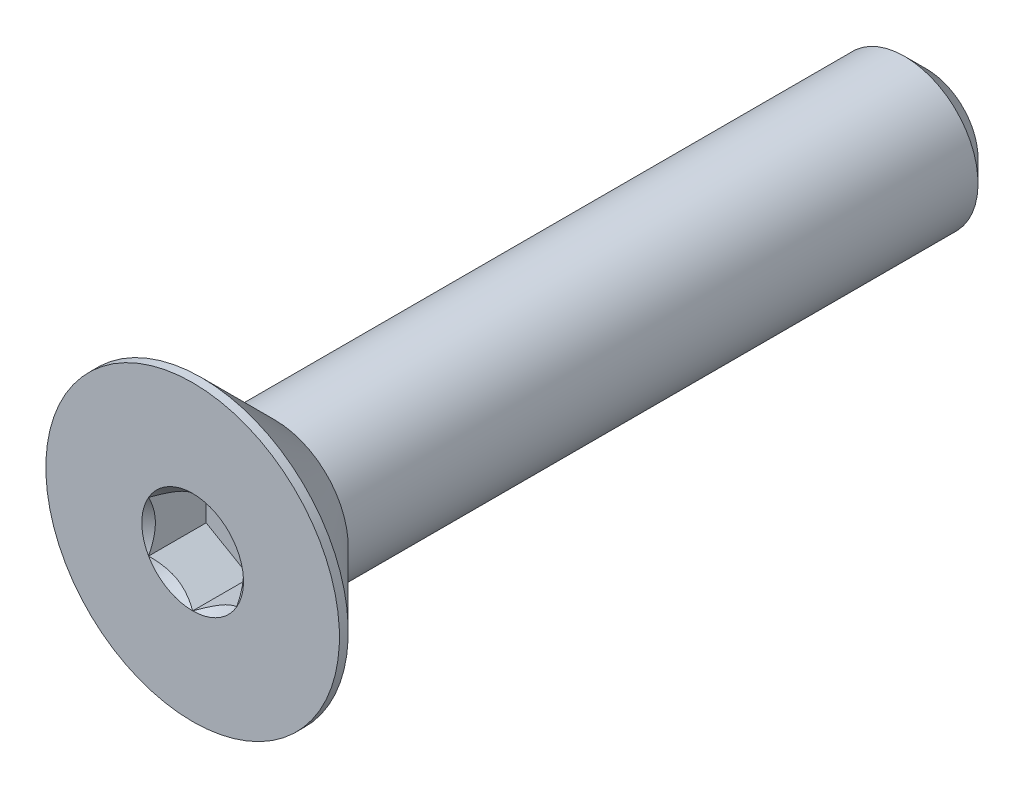
ISO-10303-21;
HEADER;
FILE_DESCRIPTION(('STEP AP214'),'2;1');
FILE_NAME('part.step','',(''),(''),'','','');
FILE_SCHEMA(('AUTOMOTIVE_DESIGN { 1 0 10303 214 1 1 1 1 }'));
ENDSEC;
DATA;
#1=APPLICATION_CONTEXT('core data for automotive mechanical design processes');
#2=APPLICATION_PROTOCOL_DEFINITION('international standard','automotive_design',2000,#1);
#3=PRODUCT_CONTEXT('',#1,'mechanical');
#4=PRODUCT('Part','Part','',(#3));
#5=PRODUCT_RELATED_PRODUCT_CATEGORY('part','',(#4));
#6=PRODUCT_DEFINITION_FORMATION('','',#4);
#7=PRODUCT_DEFINITION_CONTEXT('part definition',#1,'design');
#8=PRODUCT_DEFINITION('design','',#6,#7);
#9=PRODUCT_DEFINITION_SHAPE('','',#8);
#10=(LENGTH_UNIT() NAMED_UNIT(*) SI_UNIT(.MILLI.,.METRE.));
#11=(NAMED_UNIT(*) PLANE_ANGLE_UNIT() SI_UNIT($,.RADIAN.));
#12=(NAMED_UNIT(*) SI_UNIT($,.STERADIAN.) SOLID_ANGLE_UNIT());
#13=UNCERTAINTY_MEASURE_WITH_UNIT(LENGTH_MEASURE(1.E-05),#10,'distance_accuracy_value','');
#14=(GEOMETRIC_REPRESENTATION_CONTEXT(3) GLOBAL_UNCERTAINTY_ASSIGNED_CONTEXT((#13)) GLOBAL_UNIT_ASSIGNED_CONTEXT((#10,
#11,#12)) REPRESENTATION_CONTEXT('',''));
#15=CARTESIAN_POINT('',(0.,0.,0.));
#16=DIRECTION('',(0.,0.,1.));
#17=DIRECTION('',(1.,0.,0.));
#18=AXIS2_PLACEMENT_3D('',#15,#16,#17);
#19=CARTESIAN_POINT('',(0.,0.,-12.5));
#20=DIRECTION('',(0.,0.,-1.));
#21=DIRECTION('',(0.,1.,0.));
#22=AXIS2_PLACEMENT_3D('',#19,#20,#21);
#23=CYLINDRICAL_SURFACE('',#22,2.5);
#24=CARTESIAN_POINT('',(0.,0.,9.7));
#25=DIRECTION('',(0.,0.,-1.));
#26=DIRECTION('',(0.,1.,0.));
#27=AXIS2_PLACEMENT_3D('',#24,#25,#26);
#28=CIRCLE('',#27,2.5);
#29=CARTESIAN_POINT('',(0.,2.5,9.7));
#30=VERTEX_POINT('',#29);
#31=EDGE_CURVE('E11',#30,#30,#28,.F.);
#32=ORIENTED_EDGE('',*,*,#31,.F.);
#33=EDGE_LOOP('',(#32));
#34=FACE_BOUND('',#33,.T.);
#35=CARTESIAN_POINT('',(0.,0.,-11.75));
#36=DIRECTION('',(0.,0.,-1.));
#37=DIRECTION('',(0.,1.,0.));
#38=AXIS2_PLACEMENT_3D('',#35,#36,#37);
#39=CIRCLE('',#38,2.5);
#40=CARTESIAN_POINT('',(0.,2.5,-11.75));
#41=VERTEX_POINT('',#40);
#42=EDGE_CURVE('E41',#41,#41,#39,.F.);
#43=ORIENTED_EDGE('',*,*,#42,.T.);
#44=EDGE_LOOP('',(#43));
#45=FACE_BOUND('',#44,.T.);
#46=ADVANCED_FACE('F33',(#34,#45),#23,.T.);
#47=CARTESIAN_POINT('',(0.,2.5,-12.5));
#48=DIRECTION('',(0.,0.,-1.));
#49=DIRECTION('',(0.,1.,0.));
#50=AXIS2_PLACEMENT_3D('',#47,#48,#49);
#51=PLANE('',#50);
#52=CARTESIAN_POINT('',(0.,0.,-12.5));
#53=DIRECTION('',(0.,0.,-1.));
#54=DIRECTION('',(0.,1.,0.));
#55=AXIS2_PLACEMENT_3D('',#52,#53,#54);
#56=CIRCLE('',#55,1.74999999999999);
#57=CARTESIAN_POINT('',(0.,1.75,-12.5));
#58=VERTEX_POINT('',#57);
#59=EDGE_CURVE('E145',#58,#58,#56,.T.);
#60=ORIENTED_EDGE('',*,*,#59,.T.);
#61=EDGE_LOOP('',(#60));
#62=FACE_BOUND('',#61,.T.);
#63=ADVANCED_FACE('F154',(#62),#51,.T.);
#64=CARTESIAN_POINT('',(0.,0.,-12.5));
#65=DIRECTION('',(0.,0.,1.));
#66=DIRECTION('',(0.,-1.,0.));
#67=AXIS2_PLACEMENT_3D('',#64,#65,#66);
#68=CONICAL_SURFACE('',#67,1.74999999999999,0.785398163397447);
#69=ORIENTED_EDGE('',*,*,#42,.F.);
#70=EDGE_LOOP('',(#69));
#71=FACE_BOUND('',#70,.T.);
#72=ORIENTED_EDGE('',*,*,#59,.F.);
#73=EDGE_LOOP('',(#72));
#74=FACE_BOUND('',#73,.T.);
#75=ADVANCED_FACE('F35',(#71,#74),#68,.T.);
#76=CARTESIAN_POINT('',(0.,0.,-12.5));
#77=DIRECTION('',(0.,0.,-1.));
#78=DIRECTION('',(0.,1.,0.));
#79=AXIS2_PLACEMENT_3D('',#76,#77,#78);
#80=CYLINDRICAL_SURFACE('',#79,5.);
#81=CARTESIAN_POINT('',(0.,0.,12.5));
#82=DIRECTION('',(0.,0.,-1.));
#83=DIRECTION('',(0.,1.,0.));
#84=AXIS2_PLACEMENT_3D('',#81,#82,#83);
#85=CIRCLE('',#84,5.);
#86=CARTESIAN_POINT('',(0.,5.,12.5));
#87=VERTEX_POINT('',#86);
#88=EDGE_CURVE('E125',#87,#87,#85,.T.);
#89=ORIENTED_EDGE('',*,*,#88,.T.);
#90=EDGE_LOOP('',(#89));
#91=FACE_BOUND('',#90,.T.);
#92=CARTESIAN_POINT('',(0.,0.,12.2));
#93=DIRECTION('',(0.,0.,-1.));
#94=DIRECTION('',(0.,1.,0.));
#95=AXIS2_PLACEMENT_3D('',#92,#93,#94);
#96=CIRCLE('',#95,5.);
#97=CARTESIAN_POINT('',(0.,5.,12.2));
#98=VERTEX_POINT('',#97);
#99=EDGE_CURVE('E122',#98,#98,#96,.T.);
#100=ORIENTED_EDGE('',*,*,#99,.F.);
#101=EDGE_LOOP('',(#100));
#102=FACE_BOUND('',#101,.T.);
#103=ADVANCED_FACE('F153',(#91,#102),#80,.T.);
#104=CARTESIAN_POINT('',(0.,0.,9.7));
#105=DIRECTION('',(0.,0.,1.));
#106=DIRECTION('',(0.,-1.,0.));
#107=AXIS2_PLACEMENT_3D('',#104,#105,#106);
#108=CONICAL_SURFACE('',#107,2.5,0.78539816339745);
#109=ORIENTED_EDGE('',*,*,#99,.T.);
#110=EDGE_LOOP('',(#109));
#111=FACE_BOUND('',#110,.T.);
#112=ORIENTED_EDGE('',*,*,#31,.T.);
#113=EDGE_LOOP('',(#112));
#114=FACE_BOUND('',#113,.T.);
#115=ADVANCED_FACE('F167',(#111,#114),#108,.T.);
#116=CARTESIAN_POINT('',(0.,0.,12.5));
#117=DIRECTION('',(0.,0.,1.));
#118=DIRECTION('',(0.,-1.,0.));
#119=AXIS2_PLACEMENT_3D('',#116,#117,#118);
#120=PLANE('',#119);
#121=CARTESIAN_POINT('',(0.,0.,12.5));
#122=DIRECTION('',(0.,0.,1.));
#123=DIRECTION('',(1.,0.,0.));
#124=AXIS2_PLACEMENT_3D('',#121,#122,#123);
#125=CIRCLE('',#124,1.73205080756888);
#126=CARTESIAN_POINT('',(1.5,0.866025403784443,12.5));
#127=VERTEX_POINT('',#126);
#128=CARTESIAN_POINT('',(0.,1.73205080756888,12.5));
#129=VERTEX_POINT('',#128);
#130=EDGE_CURVE('E92',#127,#129,#125,.T.);
#131=ORIENTED_EDGE('',*,*,#130,.F.);
#132=CARTESIAN_POINT('',(0.,0.,12.5));
#133=DIRECTION('',(0.,0.,1.));
#134=DIRECTION('',(1.,0.,0.));
#135=AXIS2_PLACEMENT_3D('',#132,#133,#134);
#136=CIRCLE('',#135,1.73205080756888);
#137=CARTESIAN_POINT('',(1.49999999999999,-0.866025403784446,12.5));
#138=VERTEX_POINT('',#137);
#139=EDGE_CURVE('E104',#138,#127,#136,.T.);
#140=ORIENTED_EDGE('',*,*,#139,.F.);
#141=CARTESIAN_POINT('',(0.,0.,12.5));
#142=DIRECTION('',(0.,0.,1.));
#143=DIRECTION('',(1.,0.,0.));
#144=AXIS2_PLACEMENT_3D('',#141,#142,#143);
#145=CIRCLE('',#144,1.73205080756888);
#146=CARTESIAN_POINT('',(0.,-1.73205080756887,12.5));
#147=VERTEX_POINT('',#146);
#148=EDGE_CURVE('E238',#147,#138,#145,.T.);
#149=ORIENTED_EDGE('',*,*,#148,.F.);
#150=CARTESIAN_POINT('',(0.,0.,12.5));
#151=DIRECTION('',(0.,0.,1.));
#152=DIRECTION('',(1.,0.,0.));
#153=AXIS2_PLACEMENT_3D('',#150,#151,#152);
#154=CIRCLE('',#153,1.73205080756888);
#155=CARTESIAN_POINT('',(-1.5,-0.866025403784427,12.5));
#156=VERTEX_POINT('',#155);
#157=EDGE_CURVE('E117',#156,#147,#154,.T.);
#158=ORIENTED_EDGE('',*,*,#157,.F.);
#159=CARTESIAN_POINT('',(0.,0.,12.5));
#160=DIRECTION('',(0.,0.,1.));
#161=DIRECTION('',(1.,0.,0.));
#162=AXIS2_PLACEMENT_3D('',#159,#160,#161);
#163=CIRCLE('',#162,1.73205080756888);
#164=CARTESIAN_POINT('',(-1.5,0.866025403784438,12.5));
#165=VERTEX_POINT('',#164);
#166=EDGE_CURVE('E239',#165,#156,#163,.T.);
#167=ORIENTED_EDGE('',*,*,#166,.F.);
#168=CARTESIAN_POINT('',(0.,0.,12.5));
#169=DIRECTION('',(0.,0.,1.));
#170=DIRECTION('',(1.,0.,0.));
#171=AXIS2_PLACEMENT_3D('',#168,#169,#170);
#172=CIRCLE('',#171,1.73205080756888);
#173=EDGE_CURVE('E107',#129,#165,#172,.T.);
#174=ORIENTED_EDGE('',*,*,#173,.F.);
#175=EDGE_LOOP('',(#131,#140,#149,#158,#167,#174));
#176=FACE_BOUND('',#175,.T.);
#177=ORIENTED_EDGE('',*,*,#88,.F.);
#178=EDGE_LOOP('',(#177));
#179=FACE_BOUND('',#178,.T.);
#180=ADVANCED_FACE('F101',(#176,#179),#120,.T.);
#181=CARTESIAN_POINT('',(1.5,0.86602540378444,10.54));
#182=DIRECTION('',(0.5,0.866025403784438,0.));
#183=DIRECTION('',(-0.866025403784439,0.5,0.));
#184=AXIS2_PLACEMENT_3D('',#181,#182,#183);
#185=PLANE('',#184);
#186=DIRECTION('',(0.,0.,1.));
#187=VECTOR('',#186,1.);
#188=CARTESIAN_POINT('',(1.5,0.86602540378444,10.54));
#189=LINE('',#188,#187);
#190=CARTESIAN_POINT('',(1.5,0.86602540378444,10.54));
#191=VERTEX_POINT('',#190);
#192=EDGE_CURVE('E48',#191,#127,#189,.T.);
#193=ORIENTED_EDGE('',*,*,#192,.T.);
#194=CARTESIAN_POINT('',(-0.000200000000000019,1.73216627762272,12.5001154816001));
#195=CARTESIAN_POINT('',(0.0513677907370754,1.70239359975915,12.4703654760673));
#196=CARTESIAN_POINT('',(0.1037979176652,1.67212305186355,12.4423624839103));
#197=CARTESIAN_POINT('',(0.210709034055596,1.61039789003619,12.3910892304401));
#198=CARTESIAN_POINT('',(0.26520019581466,1.57893740312614,12.3678475050444));
#199=CARTESIAN_POINT('',(0.375079081357247,1.51549879897987,12.3280337289922));
#200=CARTESIAN_POINT('',(0.430438809095198,1.4835368452681,12.3113615856709));
#201=CARTESIAN_POINT('',(0.542377257477149,1.41890915196211,12.2856744568181));
#202=CARTESIAN_POINT('',(0.598952556553007,1.38624538781118,12.2766402904789));
#203=CARTESIAN_POINT('',(0.696455389516439,1.329952100953,12.2684890812268));
#204=CARTESIAN_POINT('',(0.737256908280464,1.30639533311124,12.2672822529892));
#205=CARTESIAN_POINT('',(0.818787969615856,1.25932335290194,12.2693140571623));
#206=CARTESIAN_POINT('',(0.859517494314628,1.23580815085314,12.2725536707483));
#207=CARTESIAN_POINT('',(0.940584402163413,1.18900414978427,12.283291985982));
#208=CARTESIAN_POINT('',(0.980921384598285,1.1657155821172,12.2907946530187));
#209=CARTESIAN_POINT('',(1.06091833691403,1.11952932016335,12.3096516119283));
#210=CARTESIAN_POINT('',(1.1005780085162,1.09663179808787,12.3210075570186));
#211=CARTESIAN_POINT('',(1.20216313477448,1.03798159809699,12.3547216475927));
#212=CARTESIAN_POINT('',(1.26345855370969,1.00259267147466,12.3796218490934));
#213=CARTESIAN_POINT('',(1.35358562846331,0.950557780604376,12.4216566532716));
#214=CARTESIAN_POINT('',(1.38328513990772,0.933410759677149,12.4364251535591));
#215=CARTESIAN_POINT('',(1.44213790138375,0.899432101996408,12.4673105659402));
#216=CARTESIAN_POINT('',(1.47129140422064,0.882600319285711,12.4834268341217));
#217=CARTESIAN_POINT('',(1.5002,0.865909933730602,12.5001154816001));
#218=B_SPLINE_CURVE_WITH_KNOTS('',3,(#194,#195,#196,#197,#198,#199,#200,#201,#202,#203,#204,
#205,#206,#207,#208,#209,#210,#211,#212,#213,#214,#215,#216,#217),.UNSPECIFIED.,.F.,.F.,(4,2,2,
2,2,2,2,2,2,2,2,4),(0.,0.199829143693304,0.400822987382387,0.598623720538179,0.795926240188887,
0.937113067959879,1.07833105577193,1.21968061668221,1.36109089931054,1.58570969637565,
1.69770705470963,1.80965120737194),.UNSPECIFIED.);
#219=EDGE_CURVE('E89',#129,#127,#218,.T.);
#220=ORIENTED_EDGE('',*,*,#219,.F.);
#221=DIRECTION('',(0.,0.,1.));
#222=VECTOR('',#221,1.);
#223=CARTESIAN_POINT('',(0.,1.73205080756888,10.54));
#224=LINE('',#223,#222);
#225=CARTESIAN_POINT('',(0.,1.73205080756888,10.54));
#226=VERTEX_POINT('',#225);
#227=EDGE_CURVE('E141',#226,#129,#224,.T.);
#228=ORIENTED_EDGE('',*,*,#227,.F.);
#229=DIRECTION('',(-0.866025403784439,0.5,0.));
#230=VECTOR('',#229,1.);
#231=CARTESIAN_POINT('',(1.5,0.86602540378444,10.54));
#232=LINE('',#231,#230);
#233=EDGE_CURVE('E114',#191,#226,#232,.T.);
#234=ORIENTED_EDGE('',*,*,#233,.F.);
#235=EDGE_LOOP('',(#193,#220,#228,#234));
#236=FACE_BOUND('',#235,.T.);
#237=ADVANCED_FACE('F119',(#236),#185,.F.);
#238=CARTESIAN_POINT('',(1.5,-0.86602540378444,10.54));
#239=DIRECTION('',(1.,0.,0.));
#240=DIRECTION('',(0.,0.,-1.));
#241=AXIS2_PLACEMENT_3D('',#238,#239,#240);
#242=PLANE('',#241);
#243=DIRECTION('',(0.,0.,1.));
#244=VECTOR('',#243,1.);
#245=CARTESIAN_POINT('',(1.5,-0.86602540378444,10.54));
#246=LINE('',#245,#244);
#247=CARTESIAN_POINT('',(1.5,-0.86602540378444,10.54));
#248=VERTEX_POINT('',#247);
#249=EDGE_CURVE('E56',#248,#138,#246,.T.);
#250=ORIENTED_EDGE('',*,*,#249,.T.);
#251=CARTESIAN_POINT('',(1.5,-1.72720812969693,13.0555785162708));
#252=CARTESIAN_POINT('',(1.5,-1.68515175699268,13.0238299078574));
#253=CARTESIAN_POINT('',(1.5,-1.64286104748674,12.9923925938074));
#254=CARTESIAN_POINT('',(1.5,-1.55771581035942,12.9302690875564));
#255=CARTESIAN_POINT('',(1.5,-1.51486114386669,12.8995830858922));
#256=CARTESIAN_POINT('',(1.5,-1.38468134151271,12.8084071924272));
#257=CARTESIAN_POINT('',(1.5,-1.29637976071654,12.7492883434268));
#258=CARTESIAN_POINT('',(1.5,-1.11121478730467,12.6332309963165));
#259=CARTESIAN_POINT('',(1.5,-1.01415038238167,12.576609558733));
#260=CARTESIAN_POINT('',(1.5,-0.815173408897605,12.4730368812657));
#261=CARTESIAN_POINT('',(1.5,-0.713278669253284,12.4260530415417));
#262=CARTESIAN_POINT('',(1.5,-0.56033377494311,12.3685726684308));
#263=CARTESIAN_POINT('',(1.5,-0.51154798294804,12.3520753877573));
#264=CARTESIAN_POINT('',(1.5,-0.412798620136865,12.322997512927));
#265=CARTESIAN_POINT('',(1.5,-0.362834968437561,12.310417188594));
#266=CARTESIAN_POINT('',(1.5,-0.26286323544498,12.2900361941468));
#267=CARTESIAN_POINT('',(1.5,-0.21287211380802,12.282153632746));
#268=CARTESIAN_POINT('',(1.5,-0.112355243569542,12.271322063969));
#269=CARTESIAN_POINT('',(1.5,-0.0618295883726245,12.2683722085244));
#270=CARTESIAN_POINT('',(1.5,0.037429173332388,12.2676248577249));
#271=CARTESIAN_POINT('',(1.5,0.086160967200303,12.2696447335581));
#272=CARTESIAN_POINT('',(1.5,0.183206937768831,12.2783225528968));
#273=CARTESIAN_POINT('',(1.5,0.231521073438273,12.2849809469685));
#274=CARTESIAN_POINT('',(1.5,0.32819985342544,12.3026852441226));
#275=CARTESIAN_POINT('',(1.5,0.376550616310333,12.313805811257));
#276=CARTESIAN_POINT('',(1.5,0.472195697125603,12.3398434140487));
#277=CARTESIAN_POINT('',(1.5,0.519490103092746,12.3547601320409));
#278=CARTESIAN_POINT('',(1.5,0.66839128269663,12.4073352235961));
#279=CARTESIAN_POINT('',(1.5,0.767878709508558,12.450981287472));
#280=CARTESIAN_POINT('',(1.5,0.962179866690728,12.5480229945931));
#281=CARTESIAN_POINT('',(1.5,1.05697519961444,12.6014536650895));
#282=CARTESIAN_POINT('',(1.5,1.23814273533383,12.7116858520046));
#283=CARTESIAN_POINT('',(1.5,1.3246994218129,12.7681879206986));
#284=CARTESIAN_POINT('',(1.5,1.45222331290674,12.8555343015787));
#285=CARTESIAN_POINT('',(1.5,1.49418091978756,12.88495775868));
#286=CARTESIAN_POINT('',(1.5,1.57752272931477,12.9445828218305));
#287=CARTESIAN_POINT('',(1.5,1.61890708647355,12.9747842116644));
#288=CARTESIAN_POINT('',(1.5,1.66005278019494,13.0053081786095));
#289=B_SPLINE_CURVE_WITH_KNOTS('',3,(#251,#252,#253,#254,#255,#256,#257,#258,#259,#260,#261,
#262,#263,#264,#265,#266,#267,#268,#269,#270,#271,#272,#273,#274,#275,#276,#277,#278,#279,#280,
#281,#282,#283,#284,#285,#286,#287,#288),.UNSPECIFIED.,.F.,.F.,(4,2,2,2,2,2,2,2,2,2,2,2,2,2,2,2,
2,2,4),(0.,0.15807954898267,0.316198780993945,0.634850417346964,0.971690311361518,
1.30737131660668,1.4617396112709,1.61611853740678,1.76772101421411,1.9192974236854,
2.06538741209602,2.21149159305546,2.36014984633874,2.50879566386711,2.83376031422675,
3.15991186985653,3.46985601802199,3.62358896039975,3.77727962642072),.UNSPECIFIED.);
#290=EDGE_CURVE('E113',#127,#138,#289,.F.);
#291=ORIENTED_EDGE('',*,*,#290,.F.);
#292=ORIENTED_EDGE('',*,*,#192,.F.);
#293=DIRECTION('',(0.,1.,0.));
#294=VECTOR('',#293,1.);
#295=CARTESIAN_POINT('',(1.5,-0.86602540378444,10.54));
#296=LINE('',#295,#294);
#297=EDGE_CURVE('E130',#248,#191,#296,.T.);
#298=ORIENTED_EDGE('',*,*,#297,.F.);
#299=EDGE_LOOP('',(#250,#291,#292,#298));
#300=FACE_BOUND('',#299,.T.);
#301=ADVANCED_FACE('F116',(#300),#242,.F.);
#302=CARTESIAN_POINT('',(0.,-1.73205080756888,10.54));
#303=DIRECTION('',(0.5,-0.866025403784439,0.));
#304=DIRECTION('',(0.866025403784439,0.5,0.));
#305=AXIS2_PLACEMENT_3D('',#302,#303,#304);
#306=PLANE('',#305);
#307=DIRECTION('',(0.,0.,1.));
#308=VECTOR('',#307,1.);
#309=CARTESIAN_POINT('',(0.,-1.73205080756888,10.54));
#310=LINE('',#309,#308);
#311=CARTESIAN_POINT('',(0.,-1.73205080756888,10.54));
#312=VERTEX_POINT('',#311);
#313=EDGE_CURVE('E127',#312,#147,#310,.T.);
#314=ORIENTED_EDGE('',*,*,#313,.T.);
#315=CARTESIAN_POINT('',(1.5002,-0.865909933730602,12.5001154816001));
#316=CARTESIAN_POINT('',(1.44863220926292,-0.895682611594166,12.4703654760673));
#317=CARTESIAN_POINT('',(1.3962020823348,-0.925953159489766,12.4423624839103));
#318=CARTESIAN_POINT('',(1.2892909659444,-0.987678321317124,12.3910892304402));
#319=CARTESIAN_POINT('',(1.23479980418534,-1.01913880822718,12.3678475050444));
#320=CARTESIAN_POINT('',(1.12492091864275,-1.08257741237344,12.3280337289922));
#321=CARTESIAN_POINT('',(1.0695611909048,-1.11453936608521,12.3113615856709));
#322=CARTESIAN_POINT('',(0.957622742522851,-1.1791670593912,12.2856744568181));
#323=CARTESIAN_POINT('',(0.901047443446993,-1.21183082354213,12.2766402904789));
#324=CARTESIAN_POINT('',(0.80354461048356,-1.26812411040032,12.2684890812269));
#325=CARTESIAN_POINT('',(0.762743091719535,-1.29168087824208,12.2672822529892));
#326=CARTESIAN_POINT('',(0.681212030384142,-1.33875285845138,12.2693140571623));
#327=CARTESIAN_POINT('',(0.64048250568537,-1.36226806050018,12.2725536707483));
#328=CARTESIAN_POINT('',(0.559415597836584,-1.40907206156905,12.283291985982));
#329=CARTESIAN_POINT('',(0.519078615401712,-1.43236062923612,12.2907946530187));
#330=CARTESIAN_POINT('',(0.439081663085969,-1.47854689118997,12.3096516119283));
#331=CARTESIAN_POINT('',(0.399421991483791,-1.50144441326545,12.3210075570186));
#332=CARTESIAN_POINT('',(0.297836865225514,-1.56009461325633,12.3547216475927));
#333=CARTESIAN_POINT('',(0.23654144629031,-1.59548353987866,12.3796218490934));
#334=CARTESIAN_POINT('',(0.146414371536686,-1.64751843074894,12.4216566532716));
#335=CARTESIAN_POINT('',(0.116714860092281,-1.66466545167617,12.4364251535591));
#336=CARTESIAN_POINT('',(0.0578620986162486,-1.69864410935691,12.4673105659402));
#337=CARTESIAN_POINT('',(0.0287085957793626,-1.71547589206761,12.4834268341217));
#338=CARTESIAN_POINT('',(-0.00019999999999992,-1.73216627762272,12.5001154816001));
#339=B_SPLINE_CURVE_WITH_KNOTS('',3,(#315,#316,#317,#318,#319,#320,#321,#322,#323,#324,#325,
#326,#327,#328,#329,#330,#331,#332,#333,#334,#335,#336,#337,#338),.UNSPECIFIED.,.F.,.F.,(4,2,2,
2,2,2,2,2,2,2,2,4),(0.,0.199829143693304,0.400822987382387,0.598623720538178,0.795926240188886,
0.937113067959879,1.07833105577193,1.21968061668222,1.36109089931054,1.58570969637565,
1.69770705470964,1.80965120737193),.UNSPECIFIED.);
#340=EDGE_CURVE('E236',#138,#147,#339,.T.);
#341=ORIENTED_EDGE('',*,*,#340,.F.);
#342=ORIENTED_EDGE('',*,*,#249,.F.);
#343=DIRECTION('',(0.866025403784439,0.5,0.));
#344=VECTOR('',#343,1.);
#345=CARTESIAN_POINT('',(0.,-1.73205080756888,10.54));
#346=LINE('',#345,#344);
#347=EDGE_CURVE('E228',#312,#248,#346,.T.);
#348=ORIENTED_EDGE('',*,*,#347,.F.);
#349=EDGE_LOOP('',(#314,#341,#342,#348));
#350=FACE_BOUND('',#349,.T.);
#351=ADVANCED_FACE('F192',(#350),#306,.F.);
#352=CARTESIAN_POINT('',(-1.5,-0.866025403784439,10.54));
#353=DIRECTION('',(-0.5,-0.866025403784438,0.));
#354=DIRECTION('',(0.866025403784439,-0.5,0.));
#355=AXIS2_PLACEMENT_3D('',#352,#353,#354);
#356=PLANE('',#355);
#357=DIRECTION('',(0.,0.,1.));
#358=VECTOR('',#357,1.);
#359=CARTESIAN_POINT('',(-1.5,-0.866025403784439,10.54));
#360=LINE('',#359,#358);
#361=CARTESIAN_POINT('',(-1.5,-0.866025403784439,10.54));
#362=VERTEX_POINT('',#361);
#363=EDGE_CURVE('E135',#362,#156,#360,.T.);
#364=ORIENTED_EDGE('',*,*,#363,.T.);
#365=CARTESIAN_POINT('',(0.000199999999999358,-1.73216627762272,12.5001154816001));
#366=CARTESIAN_POINT('',(-0.0513677907370768,-1.70239359975915,12.4703654760673));
#367=CARTESIAN_POINT('',(-0.103797917665202,-1.67212305186355,12.4423624839103));
#368=CARTESIAN_POINT('',(-0.210709034055599,-1.61039789003619,12.3910892304402));
#369=CARTESIAN_POINT('',(-0.265200195814663,-1.57893740312614,12.3678475050444));
#370=CARTESIAN_POINT('',(-0.375079081357251,-1.51549879897987,12.3280337289922));
#371=CARTESIAN_POINT('',(-0.430438809095202,-1.4835368452681,12.3113615856709));
#372=CARTESIAN_POINT('',(-0.542377257477154,-1.41890915196211,12.2856744568181));
#373=CARTESIAN_POINT('',(-0.598952556553012,-1.38624538781118,12.2766402904789));
#374=CARTESIAN_POINT('',(-0.696455389516445,-1.32995210095299,12.2684890812269));
#375=CARTESIAN_POINT('',(-0.73725690828047,-1.30639533311124,12.2672822529892));
#376=CARTESIAN_POINT('',(-0.818787969615863,-1.25932335290193,12.2693140571623));
#377=CARTESIAN_POINT('',(-0.859517494314635,-1.23580815085313,12.2725536707483));
#378=CARTESIAN_POINT('',(-0.940584402163421,-1.18900414978426,12.283291985982));
#379=CARTESIAN_POINT('',(-0.980921384598293,-1.16571558211719,12.2907946530187));
#380=CARTESIAN_POINT('',(-1.06091833691404,-1.11952932016335,12.3096516119283));
#381=CARTESIAN_POINT('',(-1.10057800851621,-1.09663179808786,12.3210075570186));
#382=CARTESIAN_POINT('',(-1.20216313477449,-1.03798159809698,12.3547216475927));
#383=CARTESIAN_POINT('',(-1.26345855370969,-1.00259267147465,12.3796218490934));
#384=CARTESIAN_POINT('',(-1.35358562846332,-0.950557780604373,12.4216566532716));
#385=CARTESIAN_POINT('',(-1.38328513990772,-0.933410759677146,12.4364251535591));
#386=CARTESIAN_POINT('',(-1.44213790138375,-0.899432101996406,12.4673105659402));
#387=CARTESIAN_POINT('',(-1.47129140422064,-0.882600319285709,12.4834268341217));
#388=CARTESIAN_POINT('',(-1.5002,-0.865909933730601,12.5001154816001));
#389=B_SPLINE_CURVE_WITH_KNOTS('',3,(#365,#366,#367,#368,#369,#370,#371,#372,#373,#374,#375,
#376,#377,#378,#379,#380,#381,#382,#383,#384,#385,#386,#387,#388),.UNSPECIFIED.,.F.,.F.,(4,2,2,
2,2,2,2,2,2,2,2,4),(0.,0.199829143693306,0.40082298738239,0.598623720538184,0.795926240188893,
0.937113067959886,1.07833105577193,1.21968061668222,1.36109089931055,1.58570969637566,
1.69770705470964,1.80965120737194),.UNSPECIFIED.);
#390=EDGE_CURVE('E210',#147,#156,#389,.T.);
#391=ORIENTED_EDGE('',*,*,#390,.F.);
#392=ORIENTED_EDGE('',*,*,#313,.F.);
#393=DIRECTION('',(0.866025403784438,-0.5,0.));
#394=VECTOR('',#393,1.);
#395=CARTESIAN_POINT('',(-1.5,-0.866025403784439,10.54));
#396=LINE('',#395,#394);
#397=EDGE_CURVE('E226',#362,#312,#396,.T.);
#398=ORIENTED_EDGE('',*,*,#397,.F.);
#399=EDGE_LOOP('',(#364,#391,#392,#398));
#400=FACE_BOUND('',#399,.T.);
#401=ADVANCED_FACE('F188',(#400),#356,.F.);
#402=CARTESIAN_POINT('',(-1.5,0.866025403784439,10.54));
#403=DIRECTION('',(-1.,0.,0.));
#404=DIRECTION('',(0.,-1.,0.));
#405=AXIS2_PLACEMENT_3D('',#402,#403,#404);
#406=PLANE('',#405);
#407=DIRECTION('',(0.,0.,1.));
#408=VECTOR('',#407,1.);
#409=CARTESIAN_POINT('',(-1.5,0.866025403784439,10.54));
#410=LINE('',#409,#408);
#411=CARTESIAN_POINT('',(-1.5,0.866025403784439,10.54));
#412=VERTEX_POINT('',#411);
#413=EDGE_CURVE('E138',#412,#165,#410,.T.);
#414=ORIENTED_EDGE('',*,*,#413,.T.);
#415=CARTESIAN_POINT('',(-1.5,-1.72720812969693,13.0555785162708));
#416=CARTESIAN_POINT('',(-1.5,-1.68515175699268,13.0238299078574));
#417=CARTESIAN_POINT('',(-1.5,-1.64286104748674,12.9923925938074));
#418=CARTESIAN_POINT('',(-1.5,-1.55771581035942,12.9302690875564));
#419=CARTESIAN_POINT('',(-1.5,-1.51486114386668,12.8995830858922));
#420=CARTESIAN_POINT('',(-1.5,-1.3846813415127,12.8084071924272));
#421=CARTESIAN_POINT('',(-1.5,-1.29637976071654,12.7492883434268));
#422=CARTESIAN_POINT('',(-1.5,-1.11121478730467,12.6332309963165));
#423=CARTESIAN_POINT('',(-1.5,-1.01415038238167,12.576609558733));
#424=CARTESIAN_POINT('',(-1.5,-0.815173408897605,12.4730368812657));
#425=CARTESIAN_POINT('',(-1.5,-0.713278669253284,12.4260530415417));
#426=CARTESIAN_POINT('',(-1.5,-0.56033377494311,12.3685726684308));
#427=CARTESIAN_POINT('',(-1.5,-0.51154798294804,12.3520753877573));
#428=CARTESIAN_POINT('',(-1.5,-0.412798620136864,12.322997512927));
#429=CARTESIAN_POINT('',(-1.5,-0.36283496843756,12.310417188594));
#430=CARTESIAN_POINT('',(-1.5,-0.262863235444978,12.2900361941468));
#431=CARTESIAN_POINT('',(-1.5,-0.212872113808019,12.282153632746));
#432=CARTESIAN_POINT('',(-1.5,-0.112355243569541,12.271322063969));
#433=CARTESIAN_POINT('',(-1.5,-0.0618295883726232,12.2683722085244));
#434=CARTESIAN_POINT('',(-1.5,0.0374291733323892,12.2676248577249));
#435=CARTESIAN_POINT('',(-1.5,0.0861609672003043,12.2696447335581));
#436=CARTESIAN_POINT('',(-1.5,0.183206937768832,12.2783225528968));
#437=CARTESIAN_POINT('',(-1.5,0.231521073438275,12.2849809469685));
#438=CARTESIAN_POINT('',(-1.5,0.328199853425442,12.3026852441226));
#439=CARTESIAN_POINT('',(-1.5,0.376550616310334,12.313805811257));
#440=CARTESIAN_POINT('',(-1.5,0.472195697125604,12.3398434140487));
#441=CARTESIAN_POINT('',(-1.5,0.519490103092746,12.3547601320409));
#442=CARTESIAN_POINT('',(-1.5,0.66839128269663,12.4073352235961));
#443=CARTESIAN_POINT('',(-1.5,0.767878709508559,12.450981287472));
#444=CARTESIAN_POINT('',(-1.5,0.96217986669073,12.5480229945931));
#445=CARTESIAN_POINT('',(-1.5,1.05697519961444,12.6014536650895));
#446=CARTESIAN_POINT('',(-1.5,1.23814273533383,12.7116858520046));
#447=CARTESIAN_POINT('',(-1.5,1.3246994218129,12.7681879206986));
#448=CARTESIAN_POINT('',(-1.5,1.45222331290674,12.8555343015787));
#449=CARTESIAN_POINT('',(-1.5,1.49418091978756,12.88495775868));
#450=CARTESIAN_POINT('',(-1.5,1.57752272931477,12.9445828218305));
#451=CARTESIAN_POINT('',(-1.5,1.61890708647354,12.9747842116644));
#452=CARTESIAN_POINT('',(-1.5,1.66005278019494,13.0053081786095));
#453=B_SPLINE_CURVE_WITH_KNOTS('',3,(#415,#416,#417,#418,#419,#420,#421,#422,#423,#424,#425,
#426,#427,#428,#429,#430,#431,#432,#433,#434,#435,#436,#437,#438,#439,#440,#441,#442,#443,#444,
#445,#446,#447,#448,#449,#450,#451,#452),.UNSPECIFIED.,.F.,.F.,(4,2,2,2,2,2,2,2,2,2,2,2,2,2,2,2,
2,2,4),(0.,0.158079548982669,0.316198780993943,0.634850417346962,0.971690311361516,
1.30737131660668,1.46173961127089,1.61611853740678,1.76772101421411,1.91929742368539,
2.06538741209601,2.21149159305545,2.36014984633873,2.50879566386711,2.83376031422674,
3.15991186985653,3.46985601802198,3.62358896039974,3.77727962642071),.UNSPECIFIED.);
#454=EDGE_CURVE('E95',#156,#165,#453,.T.);
#455=ORIENTED_EDGE('',*,*,#454,.F.);
#456=ORIENTED_EDGE('',*,*,#363,.F.);
#457=DIRECTION('',(0.,-1.,0.));
#458=VECTOR('',#457,1.);
#459=CARTESIAN_POINT('',(-1.5,0.866025403784439,10.54));
#460=LINE('',#459,#458);
#461=EDGE_CURVE('E223',#412,#362,#460,.T.);
#462=ORIENTED_EDGE('',*,*,#461,.F.);
#463=EDGE_LOOP('',(#414,#455,#456,#462));
#464=FACE_BOUND('',#463,.T.);
#465=ADVANCED_FACE('F184',(#464),#406,.F.);
#466=CARTESIAN_POINT('',(0.,1.73205080756888,10.54));
#467=DIRECTION('',(-0.5,0.866025403784439,0.));
#468=DIRECTION('',(-0.866025403784439,-0.5,0.));
#469=AXIS2_PLACEMENT_3D('',#466,#467,#468);
#470=PLANE('',#469);
#471=ORIENTED_EDGE('',*,*,#227,.T.);
#472=CARTESIAN_POINT('',(-1.5002,0.865909933730601,12.5001154816001));
#473=CARTESIAN_POINT('',(-1.44863220926292,0.895682611594166,12.4703654760673));
#474=CARTESIAN_POINT('',(-1.3962020823348,0.925953159489766,12.4423624839103));
#475=CARTESIAN_POINT('',(-1.2892909659444,0.987678321317124,12.3910892304401));
#476=CARTESIAN_POINT('',(-1.23479980418534,1.01913880822718,12.3678475050444));
#477=CARTESIAN_POINT('',(-1.12492091864275,1.08257741237345,12.3280337289922));
#478=CARTESIAN_POINT('',(-1.0695611909048,1.11453936608522,12.3113615856709));
#479=CARTESIAN_POINT('',(-0.957622742522848,1.1791670593912,12.2856744568181));
#480=CARTESIAN_POINT('',(-0.901047443446989,1.21183082354213,12.2766402904789));
#481=CARTESIAN_POINT('',(-0.803544610483557,1.26812411040032,12.2684890812268));
#482=CARTESIAN_POINT('',(-0.762743091719532,1.29168087824208,12.2672822529892));
#483=CARTESIAN_POINT('',(-0.68121203038414,1.33875285845138,12.2693140571623));
#484=CARTESIAN_POINT('',(-0.640482505685368,1.36226806050018,12.2725536707483));
#485=CARTESIAN_POINT('',(-0.559415597836582,1.40907206156905,12.283291985982));
#486=CARTESIAN_POINT('',(-0.51907861540171,1.43236062923612,12.2907946530187));
#487=CARTESIAN_POINT('',(-0.439081663085968,1.47854689118997,12.3096516119283));
#488=CARTESIAN_POINT('',(-0.399421991483791,1.50144441326545,12.3210075570186));
#489=CARTESIAN_POINT('',(-0.297836865225514,1.56009461325633,12.3547216475927));
#490=CARTESIAN_POINT('',(-0.23654144629031,1.59548353987866,12.3796218490934));
#491=CARTESIAN_POINT('',(-0.146414371536686,1.64751843074894,12.4216566532716));
#492=CARTESIAN_POINT('',(-0.116714860092282,1.66466545167617,12.4364251535591));
#493=CARTESIAN_POINT('',(-0.0578620986162491,1.69864410935691,12.4673105659402));
#494=CARTESIAN_POINT('',(-0.0287085957793625,1.71547589206761,12.4834268341217));
#495=CARTESIAN_POINT('',(0.000200000000000425,1.73216627762272,12.5001154816001));
#496=B_SPLINE_CURVE_WITH_KNOTS('',3,(#472,#473,#474,#475,#476,#477,#478,#479,#480,#481,#482,
#483,#484,#485,#486,#487,#488,#489,#490,#491,#492,#493,#494,#495),.UNSPECIFIED.,.F.,.F.,(4,2,2,
2,2,2,2,2,2,2,2,4),(0.,0.199829143693306,0.400822987382391,0.598623720538184,0.795926240188893,
0.937113067959885,1.07833105577193,1.21968061668222,1.36109089931055,1.58570969637566,
1.69770705470964,1.80965120737194),.UNSPECIFIED.);
#497=EDGE_CURVE('E232',#165,#129,#496,.T.);
#498=ORIENTED_EDGE('',*,*,#497,.F.);
#499=ORIENTED_EDGE('',*,*,#413,.F.);
#500=DIRECTION('',(-0.866025403784439,-0.5,0.));
#501=VECTOR('',#500,1.);
#502=CARTESIAN_POINT('',(0.,1.73205080756888,10.54));
#503=LINE('',#502,#501);
#504=EDGE_CURVE('E220',#226,#412,#503,.T.);
#505=ORIENTED_EDGE('',*,*,#504,.F.);
#506=EDGE_LOOP('',(#471,#498,#499,#505));
#507=FACE_BOUND('',#506,.T.);
#508=ADVANCED_FACE('F180',(#507),#470,.F.);
#509=CARTESIAN_POINT('',(0.,0.,10.54));
#510=DIRECTION('',(0.,0.,1.));
#511=DIRECTION('',(1.,0.,0.));
#512=AXIS2_PLACEMENT_3D('',#509,#510,#511);
#513=PLANE('',#512);
#514=ORIENTED_EDGE('',*,*,#233,.T.);
#515=ORIENTED_EDGE('',*,*,#504,.T.);
#516=ORIENTED_EDGE('',*,*,#461,.T.);
#517=ORIENTED_EDGE('',*,*,#397,.T.);
#518=ORIENTED_EDGE('',*,*,#347,.T.);
#519=ORIENTED_EDGE('',*,*,#297,.T.);
#520=EDGE_LOOP('',(#514,#515,#516,#517,#518,#519));
#521=FACE_BOUND('',#520,.T.);
#522=ADVANCED_FACE('F183',(#521),#513,.T.);
#523=CARTESIAN_POINT('',(0.,0.,12.5));
#524=DIRECTION('',(0.,0.,1.));
#525=DIRECTION('',(1.,0.,0.));
#526=AXIS2_PLACEMENT_3D('',#523,#524,#525);
#527=CONICAL_SURFACE('',#526,1.73205080756888,0.78539816339745);
#528=ORIENTED_EDGE('',*,*,#497,.T.);
#529=ORIENTED_EDGE('',*,*,#173,.T.);
#530=EDGE_LOOP('',(#528,#529));
#531=FACE_BOUND('',#530,.T.);
#532=ADVANCED_FACE('F200',(#531),#527,.F.);
#533=CARTESIAN_POINT('',(0.,0.,12.5));
#534=DIRECTION('',(0.,0.,1.));
#535=DIRECTION('',(1.,0.,0.));
#536=AXIS2_PLACEMENT_3D('',#533,#534,#535);
#537=CONICAL_SURFACE('',#536,1.73205080756888,0.78539816339745);
#538=ORIENTED_EDGE('',*,*,#390,.T.);
#539=ORIENTED_EDGE('',*,*,#157,.T.);
#540=EDGE_LOOP('',(#538,#539));
#541=FACE_BOUND('',#540,.T.);
#542=ADVANCED_FACE('F202',(#541),#537,.F.);
#543=CARTESIAN_POINT('',(0.,0.,12.5));
#544=DIRECTION('',(0.,0.,1.));
#545=DIRECTION('',(1.,0.,0.));
#546=AXIS2_PLACEMENT_3D('',#543,#544,#545);
#547=CONICAL_SURFACE('',#546,1.73205080756888,0.78539816339745);
#548=ORIENTED_EDGE('',*,*,#290,.T.);
#549=ORIENTED_EDGE('',*,*,#139,.T.);
#550=EDGE_LOOP('',(#548,#549));
#551=FACE_BOUND('',#550,.T.);
#552=ADVANCED_FACE('F112',(#551),#547,.F.);
#553=CARTESIAN_POINT('',(0.,0.,12.5));
#554=DIRECTION('',(0.,0.,1.));
#555=DIRECTION('',(1.,0.,0.));
#556=AXIS2_PLACEMENT_3D('',#553,#554,#555);
#557=CONICAL_SURFACE('',#556,1.73205080756888,0.78539816339745);
#558=ORIENTED_EDGE('',*,*,#340,.T.);
#559=ORIENTED_EDGE('',*,*,#148,.T.);
#560=EDGE_LOOP('',(#558,#559));
#561=FACE_BOUND('',#560,.T.);
#562=ADVANCED_FACE('F251',(#561),#557,.F.);
#563=CARTESIAN_POINT('',(0.,0.,12.5));
#564=DIRECTION('',(0.,0.,1.));
#565=DIRECTION('',(1.,0.,0.));
#566=AXIS2_PLACEMENT_3D('',#563,#564,#565);
#567=CONICAL_SURFACE('',#566,1.73205080756888,0.78539816339745);
#568=ORIENTED_EDGE('',*,*,#454,.T.);
#569=ORIENTED_EDGE('',*,*,#166,.T.);
#570=EDGE_LOOP('',(#568,#569));
#571=FACE_BOUND('',#570,.T.);
#572=ADVANCED_FACE('F256',(#571),#567,.F.);
#573=CARTESIAN_POINT('',(0.,0.,12.5));
#574=DIRECTION('',(0.,0.,1.));
#575=DIRECTION('',(1.,0.,0.));
#576=AXIS2_PLACEMENT_3D('',#573,#574,#575);
#577=CONICAL_SURFACE('',#576,1.73205080756888,0.78539816339745);
#578=ORIENTED_EDGE('',*,*,#219,.T.);
#579=ORIENTED_EDGE('',*,*,#130,.T.);
#580=EDGE_LOOP('',(#578,#579));
#581=FACE_BOUND('',#580,.T.);
#582=ADVANCED_FACE('F91',(#581),#577,.F.);
#583=CLOSED_SHELL('',(#46,#63,#75,#103,#115,#180,#237,#301,#351,#401,#465,#508,#522,#532,#542,
#552,#562,#572,#582));
#584=MANIFOLD_SOLID_BREP('B2',#583);
#585=ADVANCED_BREP_SHAPE_REPRESENTATION('',(#18,#584),#14);
#586=SHAPE_DEFINITION_REPRESENTATION(#9,#585);
ENDSEC;
END-ISO-10303-21;
